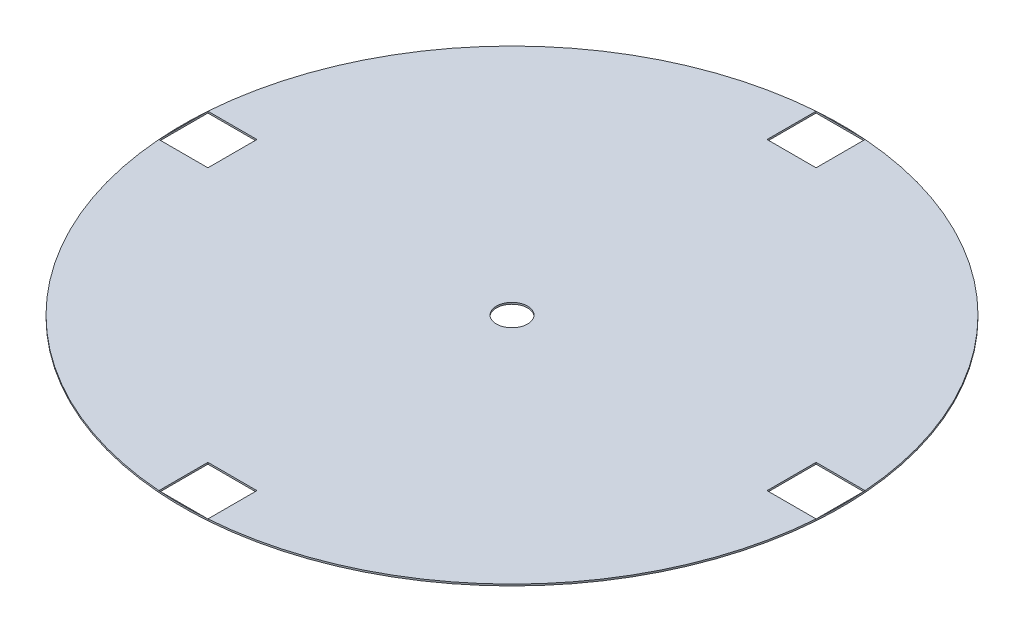
ISO-10303-21;
HEADER;
FILE_DESCRIPTION(('STEP AP214'),'2;1');
FILE_NAME('part.step','',(''),(''),'','','');
FILE_SCHEMA(('AUTOMOTIVE_DESIGN { 1 0 10303 214 1 1 1 1 }'));
ENDSEC;
DATA;
#1=APPLICATION_CONTEXT('core data for automotive mechanical design processes');
#2=APPLICATION_PROTOCOL_DEFINITION('international standard','automotive_design',2000,#1);
#3=PRODUCT_CONTEXT('',#1,'mechanical');
#4=PRODUCT('Part','Part','',(#3));
#5=PRODUCT_RELATED_PRODUCT_CATEGORY('part','',(#4));
#6=PRODUCT_DEFINITION_FORMATION('','',#4);
#7=PRODUCT_DEFINITION_CONTEXT('part definition',#1,'design');
#8=PRODUCT_DEFINITION('design','',#6,#7);
#9=PRODUCT_DEFINITION_SHAPE('','',#8);
#10=(LENGTH_UNIT() NAMED_UNIT(*) SI_UNIT(.MILLI.,.METRE.));
#11=(NAMED_UNIT(*) PLANE_ANGLE_UNIT() SI_UNIT($,.RADIAN.));
#12=(NAMED_UNIT(*) SI_UNIT($,.STERADIAN.) SOLID_ANGLE_UNIT());
#13=UNCERTAINTY_MEASURE_WITH_UNIT(LENGTH_MEASURE(1.E-05),#10,'distance_accuracy_value','');
#14=(GEOMETRIC_REPRESENTATION_CONTEXT(3) GLOBAL_UNCERTAINTY_ASSIGNED_CONTEXT((#13)) GLOBAL_UNIT_ASSIGNED_CONTEXT((#10,
#11,#12)) REPRESENTATION_CONTEXT('',''));
#15=CARTESIAN_POINT('',(0.,0.,0.));
#16=DIRECTION('',(0.,0.,1.));
#17=DIRECTION('',(1.,0.,0.));
#18=AXIS2_PLACEMENT_3D('',#15,#16,#17);
#19=CARTESIAN_POINT('',(0.,2.,0.));
#20=DIRECTION('',(0.,-1.,0.));
#21=DIRECTION('',(0.,0.,-1.));
#22=AXIS2_PLACEMENT_3D('',#19,#20,#21);
#23=CYLINDRICAL_SURFACE('',#22,403.28);
#24=CARTESIAN_POINT('',(0.,0.,0.));
#25=DIRECTION('',(0.,1.,0.));
#26=DIRECTION('',(0.,0.,1.));
#27=AXIS2_PLACEMENT_3D('',#24,#25,#26);
#28=CIRCLE('',#27,403.28);
#29=CARTESIAN_POINT('',(29.9999999999986,0.,402.162601941056));
#30=VERTEX_POINT('',#29);
#31=CARTESIAN_POINT('',(402.162601941056,0.,30.));
#32=VERTEX_POINT('',#31);
#33=EDGE_CURVE('E58',#30,#32,#28,.T.);
#34=ORIENTED_EDGE('',*,*,#33,.T.);
#35=DIRECTION('',(0.,-1.,0.));
#36=VECTOR('',#35,1.);
#37=CARTESIAN_POINT('',(402.162601941056,2.,30.));
#38=LINE('',#37,#36);
#39=CARTESIAN_POINT('',(402.162601941056,2.,30.));
#40=VERTEX_POINT('',#39);
#41=EDGE_CURVE('E164',#32,#40,#38,.F.);
#42=ORIENTED_EDGE('',*,*,#41,.T.);
#43=CARTESIAN_POINT('',(0.,2.,0.));
#44=DIRECTION('',(0.,1.,0.));
#45=DIRECTION('',(0.,0.,1.));
#46=AXIS2_PLACEMENT_3D('',#43,#44,#45);
#47=CIRCLE('',#46,403.28);
#48=CARTESIAN_POINT('',(29.9999999999986,2.,402.162601941056));
#49=VERTEX_POINT('',#48);
#50=EDGE_CURVE('E191',#49,#40,#47,.T.);
#51=ORIENTED_EDGE('',*,*,#50,.F.);
#52=DIRECTION('',(0.,-1.,0.));
#53=VECTOR('',#52,1.);
#54=CARTESIAN_POINT('',(29.9999999999986,2.,402.162601941056));
#55=LINE('',#54,#53);
#56=EDGE_CURVE('E175',#49,#30,#55,.T.);
#57=ORIENTED_EDGE('',*,*,#56,.T.);
#58=EDGE_LOOP('',(#34,#42,#51,#57));
#59=FACE_BOUND('',#58,.T.);
#60=ADVANCED_FACE('F54',(#59),#23,.T.);
#61=CARTESIAN_POINT('',(-402.162601941056,0.,29.9999999999972));
#62=VERTEX_POINT('',#61);
#63=CARTESIAN_POINT('',(-30.0000000000014,0.,402.162601941056));
#64=VERTEX_POINT('',#63);
#65=EDGE_CURVE('E181',#62,#64,#28,.T.);
#66=ORIENTED_EDGE('',*,*,#65,.T.);
#67=DIRECTION('',(0.,-1.,0.));
#68=VECTOR('',#67,1.);
#69=CARTESIAN_POINT('',(-30.0000000000014,2.,402.162601941056));
#70=LINE('',#69,#68);
#71=CARTESIAN_POINT('',(-30.0000000000014,2.,402.162601941056));
#72=VERTEX_POINT('',#71);
#73=EDGE_CURVE('E372',#64,#72,#70,.F.);
#74=ORIENTED_EDGE('',*,*,#73,.T.);
#75=CARTESIAN_POINT('',(-402.162601941056,2.,29.9999999999972));
#76=VERTEX_POINT('',#75);
#77=EDGE_CURVE('E200',#76,#72,#47,.T.);
#78=ORIENTED_EDGE('',*,*,#77,.F.);
#79=DIRECTION('',(0.,-1.,0.));
#80=VECTOR('',#79,1.);
#81=CARTESIAN_POINT('',(-402.162601941056,2.,29.9999999999972));
#82=LINE('',#81,#80);
#83=EDGE_CURVE('E370',#76,#62,#82,.T.);
#84=ORIENTED_EDGE('',*,*,#83,.T.);
#85=EDGE_LOOP('',(#66,#74,#78,#84));
#86=FACE_BOUND('',#85,.T.);
#87=ADVANCED_FACE('F315',(#86),#23,.T.);
#88=CARTESIAN_POINT('',(-29.9999999999958,0.,-402.162601941056));
#89=VERTEX_POINT('',#88);
#90=CARTESIAN_POINT('',(-402.162601941055,0.,-30.0000000000028));
#91=VERTEX_POINT('',#90);
#92=EDGE_CURVE('E220',#89,#91,#28,.T.);
#93=ORIENTED_EDGE('',*,*,#92,.T.);
#94=DIRECTION('',(0.,-1.,0.));
#95=VECTOR('',#94,1.);
#96=CARTESIAN_POINT('',(-402.162601941055,2.,-30.0000000000028));
#97=LINE('',#96,#95);
#98=CARTESIAN_POINT('',(-402.162601941055,2.,-30.0000000000028));
#99=VERTEX_POINT('',#98);
#100=EDGE_CURVE('E213',#91,#99,#97,.F.);
#101=ORIENTED_EDGE('',*,*,#100,.T.);
#102=CARTESIAN_POINT('',(-29.9999999999958,2.,-402.162601941056));
#103=VERTEX_POINT('',#102);
#104=EDGE_CURVE('E205',#103,#99,#47,.T.);
#105=ORIENTED_EDGE('',*,*,#104,.F.);
#106=DIRECTION('',(0.,-1.,0.));
#107=VECTOR('',#106,1.);
#108=CARTESIAN_POINT('',(-29.9999999999958,2.,-402.162601941056));
#109=LINE('',#108,#107);
#110=EDGE_CURVE('E207',#103,#89,#109,.T.);
#111=ORIENTED_EDGE('',*,*,#110,.T.);
#112=EDGE_LOOP('',(#93,#101,#105,#111));
#113=FACE_BOUND('',#112,.T.);
#114=ADVANCED_FACE('F298',(#113),#23,.T.);
#115=CARTESIAN_POINT('',(0.,2.,0.));
#116=DIRECTION('',(0.,1.,0.));
#117=DIRECTION('',(0.,0.,1.));
#118=AXIS2_PLACEMENT_3D('',#115,#116,#117);
#119=PLANE('',#118);
#120=DIRECTION('',(1.,0.,0.));
#121=VECTOR('',#120,1.);
#122=CARTESIAN_POINT('',(342.162601941056,2.,30.));
#123=LINE('',#122,#121);
#124=CARTESIAN_POINT('',(342.162601941056,2.,30.));
#125=VERTEX_POINT('',#124);
#126=EDGE_CURVE('E171',#125,#40,#123,.T.);
#127=ORIENTED_EDGE('',*,*,#126,.F.);
#128=DIRECTION('',(0.,0.,1.));
#129=VECTOR('',#128,1.);
#130=CARTESIAN_POINT('',(342.162601941056,2.,-30.));
#131=LINE('',#130,#129);
#132=CARTESIAN_POINT('',(342.162601941056,2.,-30.));
#133=VERTEX_POINT('',#132);
#134=EDGE_CURVE('E64',#133,#125,#131,.T.);
#135=ORIENTED_EDGE('',*,*,#134,.F.);
#136=DIRECTION('',(-1.,0.,0.));
#137=VECTOR('',#136,1.);
#138=CARTESIAN_POINT('',(402.162601941056,2.,-30.));
#139=LINE('',#138,#137);
#140=CARTESIAN_POINT('',(402.162601941056,2.,-30.));
#141=VERTEX_POINT('',#140);
#142=EDGE_CURVE('E194',#141,#133,#139,.T.);
#143=ORIENTED_EDGE('',*,*,#142,.F.);
#144=CARTESIAN_POINT('',(30.0000000000042,2.,-402.162601941055));
#145=VERTEX_POINT('',#144);
#146=EDGE_CURVE('E201',#141,#145,#47,.T.);
#147=ORIENTED_EDGE('',*,*,#146,.T.);
#148=DIRECTION('',(0.,0.,-1.));
#149=VECTOR('',#148,1.);
#150=CARTESIAN_POINT('',(29.9999999999999,2.,-342.162601941056));
#151=LINE('',#150,#149);
#152=CARTESIAN_POINT('',(29.9999999999999,2.,-342.162601941056));
#153=VERTEX_POINT('',#152);
#154=EDGE_CURVE('E232',#153,#145,#151,.T.);
#155=ORIENTED_EDGE('',*,*,#154,.F.);
#156=DIRECTION('',(1.,0.,0.));
#157=VECTOR('',#156,1.);
#158=CARTESIAN_POINT('',(-30.0000000000001,2.,-342.162601941056));
#159=LINE('',#158,#157);
#160=CARTESIAN_POINT('',(-30.0000000000001,2.,-342.162601941056));
#161=VERTEX_POINT('',#160);
#162=EDGE_CURVE('E245',#161,#153,#159,.T.);
#163=ORIENTED_EDGE('',*,*,#162,.F.);
#164=DIRECTION('',(0.,0.,1.));
#165=VECTOR('',#164,1.);
#166=CARTESIAN_POINT('',(-29.9999999999958,2.,-402.162601941056));
#167=LINE('',#166,#165);
#168=EDGE_CURVE('E242',#103,#161,#167,.T.);
#169=ORIENTED_EDGE('',*,*,#168,.F.);
#170=ORIENTED_EDGE('',*,*,#104,.T.);
#171=DIRECTION('',(-1.,0.,0.));
#172=VECTOR('',#171,1.);
#173=CARTESIAN_POINT('',(-342.162601941056,2.,-30.));
#174=LINE('',#173,#172);
#175=CARTESIAN_POINT('',(-342.162601941056,2.,-30.));
#176=VERTEX_POINT('',#175);
#177=EDGE_CURVE('E253',#176,#99,#174,.T.);
#178=ORIENTED_EDGE('',*,*,#177,.F.);
#179=DIRECTION('',(0.,0.,-1.));
#180=VECTOR('',#179,1.);
#181=CARTESIAN_POINT('',(-342.162601941056,2.,30.));
#182=LINE('',#181,#180);
#183=CARTESIAN_POINT('',(-342.162601941056,2.,30.));
#184=VERTEX_POINT('',#183);
#185=EDGE_CURVE('E266',#184,#176,#182,.T.);
#186=ORIENTED_EDGE('',*,*,#185,.F.);
#187=DIRECTION('',(1.,0.,0.));
#188=VECTOR('',#187,1.);
#189=CARTESIAN_POINT('',(-402.162601941056,2.,29.9999999999972));
#190=LINE('',#189,#188);
#191=EDGE_CURVE('E263',#76,#184,#190,.T.);
#192=ORIENTED_EDGE('',*,*,#191,.F.);
#193=ORIENTED_EDGE('',*,*,#77,.T.);
#194=DIRECTION('',(0.,0.,1.));
#195=VECTOR('',#194,1.);
#196=CARTESIAN_POINT('',(-30.0000000000001,2.,342.162601941056));
#197=LINE('',#196,#195);
#198=CARTESIAN_POINT('',(-30.0000000000001,2.,342.162601941056));
#199=VERTEX_POINT('',#198);
#200=EDGE_CURVE('E273',#199,#72,#197,.T.);
#201=ORIENTED_EDGE('',*,*,#200,.F.);
#202=DIRECTION('',(-1.,0.,0.));
#203=VECTOR('',#202,1.);
#204=CARTESIAN_POINT('',(30.0000000000001,2.,342.162601941056));
#205=LINE('',#204,#203);
#206=CARTESIAN_POINT('',(30.0000000000001,2.,342.162601941056));
#207=VERTEX_POINT('',#206);
#208=EDGE_CURVE('E282',#207,#199,#205,.T.);
#209=ORIENTED_EDGE('',*,*,#208,.F.);
#210=DIRECTION('',(0.,0.,-1.));
#211=VECTOR('',#210,1.);
#212=CARTESIAN_POINT('',(29.9999999999986,2.,402.162601941056));
#213=LINE('',#212,#211);
#214=EDGE_CURVE('E279',#49,#207,#213,.T.);
#215=ORIENTED_EDGE('',*,*,#214,.F.);
#216=ORIENTED_EDGE('',*,*,#50,.T.);
#217=EDGE_LOOP('',(#127,#135,#143,#147,#155,#163,#169,#170,#178,#186,#192,#193,#201,#209,#215,#216));
#218=FACE_BOUND('',#217,.T.);
#219=CARTESIAN_POINT('',(0.,2.,0.));
#220=DIRECTION('',(0.,1.,0.));
#221=DIRECTION('',(0.,0.,1.));
#222=AXIS2_PLACEMENT_3D('',#219,#220,#221);
#223=CIRCLE('',#222,19.05);
#224=CARTESIAN_POINT('',(0.,2.,19.05));
#225=VERTEX_POINT('',#224);
#226=EDGE_CURVE('E229',#225,#225,#223,.T.);
#227=ORIENTED_EDGE('',*,*,#226,.F.);
#228=EDGE_LOOP('',(#227));
#229=FACE_BOUND('',#228,.T.);
#230=ADVANCED_FACE('F56',(#218,#229),#119,.T.);
#231=CARTESIAN_POINT('',(0.,0.,0.));
#232=DIRECTION('',(0.,1.,0.));
#233=DIRECTION('',(0.,0.,1.));
#234=AXIS2_PLACEMENT_3D('',#231,#232,#233);
#235=PLANE('',#234);
#236=DIRECTION('',(0.,0.,1.));
#237=VECTOR('',#236,1.);
#238=CARTESIAN_POINT('',(342.162601941056,0.,-30.));
#239=LINE('',#238,#237);
#240=CARTESIAN_POINT('',(342.162601941056,0.,-30.));
#241=VERTEX_POINT('',#240);
#242=CARTESIAN_POINT('',(342.162601941056,0.,30.));
#243=VERTEX_POINT('',#242);
#244=EDGE_CURVE('E186',#241,#243,#239,.T.);
#245=ORIENTED_EDGE('',*,*,#244,.T.);
#246=DIRECTION('',(1.,0.,0.));
#247=VECTOR('',#246,1.);
#248=CARTESIAN_POINT('',(342.162601941056,0.,30.));
#249=LINE('',#248,#247);
#250=EDGE_CURVE('E168',#243,#32,#249,.T.);
#251=ORIENTED_EDGE('',*,*,#250,.T.);
#252=ORIENTED_EDGE('',*,*,#33,.F.);
#253=DIRECTION('',(0.,0.,-1.));
#254=VECTOR('',#253,1.);
#255=CARTESIAN_POINT('',(29.9999999999986,0.,402.162601941056));
#256=LINE('',#255,#254);
#257=CARTESIAN_POINT('',(30.0000000000001,0.,342.162601941056));
#258=VERTEX_POINT('',#257);
#259=EDGE_CURVE('E187',#30,#258,#256,.T.);
#260=ORIENTED_EDGE('',*,*,#259,.T.);
#261=DIRECTION('',(-1.,0.,0.));
#262=VECTOR('',#261,1.);
#263=CARTESIAN_POINT('',(30.0000000000001,0.,342.162601941056));
#264=LINE('',#263,#262);
#265=CARTESIAN_POINT('',(-30.0000000000001,0.,342.162601941056));
#266=VERTEX_POINT('',#265);
#267=EDGE_CURVE('E189',#258,#266,#264,.T.);
#268=ORIENTED_EDGE('',*,*,#267,.T.);
#269=DIRECTION('',(0.,0.,1.));
#270=VECTOR('',#269,1.);
#271=CARTESIAN_POINT('',(-30.0000000000001,0.,342.162601941056));
#272=LINE('',#271,#270);
#273=EDGE_CURVE('E258',#266,#64,#272,.T.);
#274=ORIENTED_EDGE('',*,*,#273,.T.);
#275=ORIENTED_EDGE('',*,*,#65,.F.);
#276=DIRECTION('',(1.,0.,0.));
#277=VECTOR('',#276,1.);
#278=CARTESIAN_POINT('',(-402.162601941056,0.,29.9999999999972));
#279=LINE('',#278,#277);
#280=CARTESIAN_POINT('',(-342.162601941056,0.,30.));
#281=VERTEX_POINT('',#280);
#282=EDGE_CURVE('E254',#62,#281,#279,.T.);
#283=ORIENTED_EDGE('',*,*,#282,.T.);
#284=DIRECTION('',(0.,0.,-1.));
#285=VECTOR('',#284,1.);
#286=CARTESIAN_POINT('',(-342.162601941056,0.,30.));
#287=LINE('',#286,#285);
#288=CARTESIAN_POINT('',(-342.162601941056,0.,-30.));
#289=VERTEX_POINT('',#288);
#290=EDGE_CURVE('E257',#281,#289,#287,.T.);
#291=ORIENTED_EDGE('',*,*,#290,.T.);
#292=DIRECTION('',(-1.,0.,0.));
#293=VECTOR('',#292,1.);
#294=CARTESIAN_POINT('',(-342.162601941056,0.,-30.));
#295=LINE('',#294,#293);
#296=EDGE_CURVE('E237',#289,#91,#295,.T.);
#297=ORIENTED_EDGE('',*,*,#296,.T.);
#298=ORIENTED_EDGE('',*,*,#92,.F.);
#299=DIRECTION('',(0.,0.,1.));
#300=VECTOR('',#299,1.);
#301=CARTESIAN_POINT('',(-29.9999999999958,0.,-402.162601941056));
#302=LINE('',#301,#300);
#303=CARTESIAN_POINT('',(-30.0000000000001,0.,-342.162601941056));
#304=VERTEX_POINT('',#303);
#305=EDGE_CURVE('E233',#89,#304,#302,.T.);
#306=ORIENTED_EDGE('',*,*,#305,.T.);
#307=DIRECTION('',(1.,0.,0.));
#308=VECTOR('',#307,1.);
#309=CARTESIAN_POINT('',(-30.0000000000001,0.,-342.162601941056));
#310=LINE('',#309,#308);
#311=CARTESIAN_POINT('',(29.9999999999999,0.,-342.162601941056));
#312=VERTEX_POINT('',#311);
#313=EDGE_CURVE('E236',#304,#312,#310,.T.);
#314=ORIENTED_EDGE('',*,*,#313,.T.);
#315=DIRECTION('',(0.,0.,-1.));
#316=VECTOR('',#315,1.);
#317=CARTESIAN_POINT('',(29.9999999999999,0.,-342.162601941056));
#318=LINE('',#317,#316);
#319=CARTESIAN_POINT('',(30.0000000000042,0.,-402.162601941055));
#320=VERTEX_POINT('',#319);
#321=EDGE_CURVE('E199',#312,#320,#318,.T.);
#322=ORIENTED_EDGE('',*,*,#321,.T.);
#323=CARTESIAN_POINT('',(402.162601941056,0.,-30.));
#324=VERTEX_POINT('',#323);
#325=EDGE_CURVE('E182',#324,#320,#28,.T.);
#326=ORIENTED_EDGE('',*,*,#325,.F.);
#327=DIRECTION('',(-1.,0.,0.));
#328=VECTOR('',#327,1.);
#329=CARTESIAN_POINT('',(402.162601941056,0.,-30.));
#330=LINE('',#329,#328);
#331=EDGE_CURVE('E197',#324,#241,#330,.T.);
#332=ORIENTED_EDGE('',*,*,#331,.T.);
#333=EDGE_LOOP('',(#245,#251,#252,#260,#268,#274,#275,#283,#291,#297,#298,#306,#314,#322,#326,#332));
#334=FACE_BOUND('',#333,.T.);
#335=CARTESIAN_POINT('',(0.,0.,0.));
#336=DIRECTION('',(0.,1.,0.));
#337=DIRECTION('',(0.,0.,1.));
#338=AXIS2_PLACEMENT_3D('',#335,#336,#337);
#339=CIRCLE('',#338,19.05);
#340=CARTESIAN_POINT('',(0.,0.,19.05));
#341=VERTEX_POINT('',#340);
#342=EDGE_CURVE('E198',#341,#341,#339,.T.);
#343=ORIENTED_EDGE('',*,*,#342,.T.);
#344=EDGE_LOOP('',(#343));
#345=FACE_BOUND('',#344,.T.);
#346=ADVANCED_FACE('F183',(#334,#345),#235,.F.);
#347=ORIENTED_EDGE('',*,*,#146,.F.);
#348=DIRECTION('',(0.,-1.,0.));
#349=VECTOR('',#348,1.);
#350=CARTESIAN_POINT('',(402.162601941056,2.,-30.));
#351=LINE('',#350,#349);
#352=EDGE_CURVE('E228',#141,#324,#351,.T.);
#353=ORIENTED_EDGE('',*,*,#352,.T.);
#354=ORIENTED_EDGE('',*,*,#325,.T.);
#355=DIRECTION('',(0.,-1.,0.));
#356=VECTOR('',#355,1.);
#357=CARTESIAN_POINT('',(30.0000000000042,2.,-402.162601941055));
#358=LINE('',#357,#356);
#359=EDGE_CURVE('E224',#320,#145,#358,.F.);
#360=ORIENTED_EDGE('',*,*,#359,.T.);
#361=EDGE_LOOP('',(#347,#353,#354,#360));
#362=FACE_BOUND('',#361,.T.);
#363=ADVANCED_FACE('F305',(#362),#23,.T.);
#364=CARTESIAN_POINT('',(0.,2.,0.));
#365=DIRECTION('',(0.,-1.,0.));
#366=DIRECTION('',(0.,0.,-1.));
#367=AXIS2_PLACEMENT_3D('',#364,#365,#366);
#368=CYLINDRICAL_SURFACE('',#367,19.05);
#369=ORIENTED_EDGE('',*,*,#226,.T.);
#370=EDGE_LOOP('',(#369));
#371=FACE_BOUND('',#370,.T.);
#372=ORIENTED_EDGE('',*,*,#342,.F.);
#373=EDGE_LOOP('',(#372));
#374=FACE_BOUND('',#373,.T.);
#375=ADVANCED_FACE('F301',(#371,#374),#368,.F.);
#376=CARTESIAN_POINT('',(29.9999999999999,0.,-342.162601941056));
#377=DIRECTION('',(1.,0.,0.));
#378=DIRECTION('',(0.,0.,-1.));
#379=AXIS2_PLACEMENT_3D('',#376,#377,#378);
#380=PLANE('',#379);
#381=ORIENTED_EDGE('',*,*,#154,.T.);
#382=ORIENTED_EDGE('',*,*,#359,.F.);
#383=ORIENTED_EDGE('',*,*,#321,.F.);
#384=DIRECTION('',(0.,1.,0.));
#385=VECTOR('',#384,1.);
#386=CARTESIAN_POINT('',(29.9999999999999,0.,-342.162601941056));
#387=LINE('',#386,#385);
#388=EDGE_CURVE('E246',#312,#153,#387,.T.);
#389=ORIENTED_EDGE('',*,*,#388,.T.);
#390=EDGE_LOOP('',(#381,#382,#383,#389));
#391=FACE_BOUND('',#390,.T.);
#392=ADVANCED_FACE('F304',(#391),#380,.F.);
#393=CARTESIAN_POINT('',(-29.9999999999958,0.,-402.162601941056));
#394=DIRECTION('',(-1.,0.,0.));
#395=DIRECTION('',(0.,0.,1.));
#396=AXIS2_PLACEMENT_3D('',#393,#394,#395);
#397=PLANE('',#396);
#398=ORIENTED_EDGE('',*,*,#168,.T.);
#399=DIRECTION('',(0.,1.,0.));
#400=VECTOR('',#399,1.);
#401=CARTESIAN_POINT('',(-30.0000000000001,0.,-342.162601941056));
#402=LINE('',#401,#400);
#403=EDGE_CURVE('E249',#304,#161,#402,.T.);
#404=ORIENTED_EDGE('',*,*,#403,.F.);
#405=ORIENTED_EDGE('',*,*,#305,.F.);
#406=ORIENTED_EDGE('',*,*,#110,.F.);
#407=EDGE_LOOP('',(#398,#404,#405,#406));
#408=FACE_BOUND('',#407,.T.);
#409=ADVANCED_FACE('F353',(#408),#397,.F.);
#410=CARTESIAN_POINT('',(-30.0000000000001,0.,-342.162601941056));
#411=DIRECTION('',(0.,0.,1.));
#412=DIRECTION('',(1.,0.,0.));
#413=AXIS2_PLACEMENT_3D('',#410,#411,#412);
#414=PLANE('',#413);
#415=ORIENTED_EDGE('',*,*,#162,.T.);
#416=ORIENTED_EDGE('',*,*,#388,.F.);
#417=ORIENTED_EDGE('',*,*,#313,.F.);
#418=ORIENTED_EDGE('',*,*,#403,.T.);
#419=EDGE_LOOP('',(#415,#416,#417,#418));
#420=FACE_BOUND('',#419,.T.);
#421=ADVANCED_FACE('F351',(#420),#414,.F.);
#422=CARTESIAN_POINT('',(-342.162601941056,0.,-30.));
#423=DIRECTION('',(0.,0.,-1.));
#424=DIRECTION('',(-1.,0.,0.));
#425=AXIS2_PLACEMENT_3D('',#422,#423,#424);
#426=PLANE('',#425);
#427=ORIENTED_EDGE('',*,*,#177,.T.);
#428=ORIENTED_EDGE('',*,*,#100,.F.);
#429=ORIENTED_EDGE('',*,*,#296,.F.);
#430=DIRECTION('',(0.,1.,0.));
#431=VECTOR('',#430,1.);
#432=CARTESIAN_POINT('',(-342.162601941056,0.,-30.));
#433=LINE('',#432,#431);
#434=EDGE_CURVE('E267',#289,#176,#433,.T.);
#435=ORIENTED_EDGE('',*,*,#434,.T.);
#436=EDGE_LOOP('',(#427,#428,#429,#435));
#437=FACE_BOUND('',#436,.T.);
#438=ADVANCED_FACE('F344',(#437),#426,.F.);
#439=CARTESIAN_POINT('',(-402.162601941056,0.,29.9999999999972));
#440=DIRECTION('',(0.,0.,1.));
#441=DIRECTION('',(1.,0.,0.));
#442=AXIS2_PLACEMENT_3D('',#439,#440,#441);
#443=PLANE('',#442);
#444=ORIENTED_EDGE('',*,*,#191,.T.);
#445=DIRECTION('',(0.,1.,0.));
#446=VECTOR('',#445,1.);
#447=CARTESIAN_POINT('',(-342.162601941056,0.,30.));
#448=LINE('',#447,#446);
#449=EDGE_CURVE('E270',#281,#184,#448,.T.);
#450=ORIENTED_EDGE('',*,*,#449,.F.);
#451=ORIENTED_EDGE('',*,*,#282,.F.);
#452=ORIENTED_EDGE('',*,*,#83,.F.);
#453=EDGE_LOOP('',(#444,#450,#451,#452));
#454=FACE_BOUND('',#453,.T.);
#455=ADVANCED_FACE('F341',(#454),#443,.F.);
#456=CARTESIAN_POINT('',(-342.162601941056,0.,30.));
#457=DIRECTION('',(1.,0.,0.));
#458=DIRECTION('',(0.,0.,-1.));
#459=AXIS2_PLACEMENT_3D('',#456,#457,#458);
#460=PLANE('',#459);
#461=ORIENTED_EDGE('',*,*,#185,.T.);
#462=ORIENTED_EDGE('',*,*,#434,.F.);
#463=ORIENTED_EDGE('',*,*,#290,.F.);
#464=ORIENTED_EDGE('',*,*,#449,.T.);
#465=EDGE_LOOP('',(#461,#462,#463,#464));
#466=FACE_BOUND('',#465,.T.);
#467=ADVANCED_FACE('F339',(#466),#460,.F.);
#468=CARTESIAN_POINT('',(-30.0000000000001,0.,342.162601941056));
#469=DIRECTION('',(-1.,0.,0.));
#470=DIRECTION('',(0.,0.,1.));
#471=AXIS2_PLACEMENT_3D('',#468,#469,#470);
#472=PLANE('',#471);
#473=ORIENTED_EDGE('',*,*,#200,.T.);
#474=ORIENTED_EDGE('',*,*,#73,.F.);
#475=ORIENTED_EDGE('',*,*,#273,.F.);
#476=DIRECTION('',(0.,1.,0.));
#477=VECTOR('',#476,1.);
#478=CARTESIAN_POINT('',(-30.0000000000001,0.,342.162601941056));
#479=LINE('',#478,#477);
#480=EDGE_CURVE('E283',#266,#199,#479,.T.);
#481=ORIENTED_EDGE('',*,*,#480,.T.);
#482=EDGE_LOOP('',(#473,#474,#475,#481));
#483=FACE_BOUND('',#482,.T.);
#484=ADVANCED_FACE('F332',(#483),#472,.F.);
#485=CARTESIAN_POINT('',(29.9999999999986,0.,402.162601941056));
#486=DIRECTION('',(1.,0.,0.));
#487=DIRECTION('',(0.,0.,-1.));
#488=AXIS2_PLACEMENT_3D('',#485,#486,#487);
#489=PLANE('',#488);
#490=ORIENTED_EDGE('',*,*,#214,.T.);
#491=DIRECTION('',(0.,1.,0.));
#492=VECTOR('',#491,1.);
#493=CARTESIAN_POINT('',(30.0000000000001,0.,342.162601941056));
#494=LINE('',#493,#492);
#495=EDGE_CURVE('E286',#258,#207,#494,.T.);
#496=ORIENTED_EDGE('',*,*,#495,.F.);
#497=ORIENTED_EDGE('',*,*,#259,.F.);
#498=ORIENTED_EDGE('',*,*,#56,.F.);
#499=EDGE_LOOP('',(#490,#496,#497,#498));
#500=FACE_BOUND('',#499,.T.);
#501=ADVANCED_FACE('F329',(#500),#489,.F.);
#502=CARTESIAN_POINT('',(30.0000000000001,0.,342.162601941056));
#503=DIRECTION('',(0.,0.,-1.));
#504=DIRECTION('',(-1.,0.,0.));
#505=AXIS2_PLACEMENT_3D('',#502,#503,#504);
#506=PLANE('',#505);
#507=ORIENTED_EDGE('',*,*,#208,.T.);
#508=ORIENTED_EDGE('',*,*,#480,.F.);
#509=ORIENTED_EDGE('',*,*,#267,.F.);
#510=ORIENTED_EDGE('',*,*,#495,.T.);
#511=EDGE_LOOP('',(#507,#508,#509,#510));
#512=FACE_BOUND('',#511,.T.);
#513=ADVANCED_FACE('F323',(#512),#506,.F.);
#514=CARTESIAN_POINT('',(342.162601941056,0.,30.));
#515=DIRECTION('',(0.,0.,1.));
#516=DIRECTION('',(1.,0.,0.));
#517=AXIS2_PLACEMENT_3D('',#514,#515,#516);
#518=PLANE('',#517);
#519=ORIENTED_EDGE('',*,*,#126,.T.);
#520=ORIENTED_EDGE('',*,*,#41,.F.);
#521=ORIENTED_EDGE('',*,*,#250,.F.);
#522=DIRECTION('',(0.,1.,0.));
#523=VECTOR('',#522,1.);
#524=CARTESIAN_POINT('',(342.162601941056,0.,30.));
#525=LINE('',#524,#523);
#526=EDGE_CURVE('E290',#243,#125,#525,.T.);
#527=ORIENTED_EDGE('',*,*,#526,.T.);
#528=EDGE_LOOP('',(#519,#520,#521,#527));
#529=FACE_BOUND('',#528,.T.);
#530=ADVANCED_FACE('F166',(#529),#518,.F.);
#531=CARTESIAN_POINT('',(402.162601941056,0.,-30.));
#532=DIRECTION('',(0.,0.,-1.));
#533=DIRECTION('',(-1.,0.,0.));
#534=AXIS2_PLACEMENT_3D('',#531,#532,#533);
#535=PLANE('',#534);
#536=ORIENTED_EDGE('',*,*,#142,.T.);
#537=DIRECTION('',(0.,1.,0.));
#538=VECTOR('',#537,1.);
#539=CARTESIAN_POINT('',(342.162601941056,0.,-30.));
#540=LINE('',#539,#538);
#541=EDGE_CURVE('E12',#241,#133,#540,.T.);
#542=ORIENTED_EDGE('',*,*,#541,.F.);
#543=ORIENTED_EDGE('',*,*,#331,.F.);
#544=ORIENTED_EDGE('',*,*,#352,.F.);
#545=EDGE_LOOP('',(#536,#542,#543,#544));
#546=FACE_BOUND('',#545,.T.);
#547=ADVANCED_FACE('F294',(#546),#535,.F.);
#548=CARTESIAN_POINT('',(342.162601941056,0.,-30.));
#549=DIRECTION('',(-1.,0.,0.));
#550=DIRECTION('',(0.,0.,1.));
#551=AXIS2_PLACEMENT_3D('',#548,#549,#550);
#552=PLANE('',#551);
#553=ORIENTED_EDGE('',*,*,#134,.T.);
#554=ORIENTED_EDGE('',*,*,#526,.F.);
#555=ORIENTED_EDGE('',*,*,#244,.F.);
#556=ORIENTED_EDGE('',*,*,#541,.T.);
#557=EDGE_LOOP('',(#553,#554,#555,#556));
#558=FACE_BOUND('',#557,.T.);
#559=ADVANCED_FACE('F324',(#558),#552,.F.);
#560=CLOSED_SHELL('',(#60,#87,#114,#230,#346,#363,#375,#392,#409,#421,#438,#455,#467,#484,#501,
#513,#530,#547,#559));
#561=MANIFOLD_SOLID_BREP('B2',#560);
#562=CARTESIAN_POINT('',(0.,2.,0.));
#563=DIRECTION('',(0.,-1.,0.));
#564=DIRECTION('',(0.,0.,-1.));
#565=AXIS2_PLACEMENT_3D('',#562,#563,#564);
#566=CYLINDRICAL_SURFACE('',#565,403.28);
#567=DIRECTION('',(0.,1.,0.));
#568=VECTOR('',#567,1.);
#569=CARTESIAN_POINT('',(30.0000000000042,0.,-402.162601941055));
#570=LINE('',#569,#568);
#571=CARTESIAN_POINT('',(30.0000000000042,0.,-402.162601941055));
#572=VERTEX_POINT('',#571);
#573=CARTESIAN_POINT('',(30.0000000000042,2.,-402.162601941055));
#574=VERTEX_POINT('',#573);
#575=EDGE_CURVE('E52',#572,#574,#570,.T.);
#576=ORIENTED_EDGE('',*,*,#575,.F.);
#577=CARTESIAN_POINT('',(0.,0.,0.));
#578=DIRECTION('',(0.,1.,0.));
#579=DIRECTION('',(0.,0.,1.));
#580=AXIS2_PLACEMENT_3D('',#577,#578,#579);
#581=CIRCLE('',#580,403.28);
#582=CARTESIAN_POINT('',(-29.9999999999958,0.,-402.162601941056));
#583=VERTEX_POINT('',#582);
#584=EDGE_CURVE('E516',#572,#583,#581,.T.);
#585=ORIENTED_EDGE('',*,*,#584,.T.);
#586=DIRECTION('',(0.,1.,0.));
#587=VECTOR('',#586,1.);
#588=CARTESIAN_POINT('',(-29.9999999999958,0.,-402.162601941056));
#589=LINE('',#588,#587);
#590=CARTESIAN_POINT('',(-29.9999999999958,2.,-402.162601941056));
#591=VERTEX_POINT('',#590);
#592=EDGE_CURVE('E537',#583,#591,#589,.T.);
#593=ORIENTED_EDGE('',*,*,#592,.T.);
#594=CARTESIAN_POINT('',(0.,2.,0.));
#595=DIRECTION('',(0.,1.,0.));
#596=DIRECTION('',(0.,0.,1.));
#597=AXIS2_PLACEMENT_3D('',#594,#595,#596);
#598=CIRCLE('',#597,403.28);
#599=EDGE_CURVE('E541',#574,#591,#598,.T.);
#600=ORIENTED_EDGE('',*,*,#599,.F.);
#601=EDGE_LOOP('',(#576,#585,#593,#600));
#602=FACE_BOUND('',#601,.T.);
#603=ADVANCED_FACE('F512',(#602),#566,.T.);
#604=CARTESIAN_POINT('',(0.,0.,0.));
#605=DIRECTION('',(0.,1.,0.));
#606=DIRECTION('',(0.,0.,1.));
#607=AXIS2_PLACEMENT_3D('',#604,#605,#606);
#608=PLANE('',#607);
#609=ORIENTED_EDGE('',*,*,#584,.F.);
#610=DIRECTION('',(-1.,0.,0.));
#611=VECTOR('',#610,1.);
#612=CARTESIAN_POINT('',(30.0000000000042,0.,-402.162601941055));
#613=LINE('',#612,#611);
#614=EDGE_CURVE('E546',#572,#583,#613,.T.);
#615=ORIENTED_EDGE('',*,*,#614,.T.);
#616=EDGE_LOOP('',(#609,#615));
#617=FACE_BOUND('',#616,.T.);
#618=ADVANCED_FACE('F550',(#617),#608,.F.);
#619=CARTESIAN_POINT('',(0.,2.,0.));
#620=DIRECTION('',(0.,1.,0.));
#621=DIRECTION('',(0.,0.,1.));
#622=AXIS2_PLACEMENT_3D('',#619,#620,#621);
#623=PLANE('',#622);
#624=DIRECTION('',(-1.,0.,0.));
#625=VECTOR('',#624,1.);
#626=CARTESIAN_POINT('',(30.0000000000042,2.,-402.162601941055));
#627=LINE('',#626,#625);
#628=EDGE_CURVE('E522',#574,#591,#627,.T.);
#629=ORIENTED_EDGE('',*,*,#628,.F.);
#630=ORIENTED_EDGE('',*,*,#599,.T.);
#631=EDGE_LOOP('',(#629,#630));
#632=FACE_BOUND('',#631,.T.);
#633=ADVANCED_FACE('F514',(#632),#623,.T.);
#634=CARTESIAN_POINT('',(30.0000000000042,0.,-402.162601941055));
#635=DIRECTION('',(0.,0.,-1.));
#636=DIRECTION('',(-1.,0.,0.));
#637=AXIS2_PLACEMENT_3D('',#634,#635,#636);
#638=PLANE('',#637);
#639=ORIENTED_EDGE('',*,*,#628,.T.);
#640=ORIENTED_EDGE('',*,*,#592,.F.);
#641=ORIENTED_EDGE('',*,*,#614,.F.);
#642=ORIENTED_EDGE('',*,*,#575,.T.);
#643=EDGE_LOOP('',(#639,#640,#641,#642));
#644=FACE_BOUND('',#643,.T.);
#645=ADVANCED_FACE('F536',(#644),#638,.F.);
#646=CLOSED_SHELL('',(#603,#618,#633,#645));
#647=MANIFOLD_SOLID_BREP('B6',#646);
#648=CARTESIAN_POINT('',(0.,2.,0.));
#649=DIRECTION('',(0.,-1.,0.));
#650=DIRECTION('',(0.,0.,-1.));
#651=AXIS2_PLACEMENT_3D('',#648,#649,#650);
#652=CYLINDRICAL_SURFACE('',#651,403.28);
#653=DIRECTION('',(0.,1.,0.));
#654=VECTOR('',#653,1.);
#655=CARTESIAN_POINT('',(-402.162601941055,0.,-30.0000000000028));
#656=LINE('',#655,#654);
#657=CARTESIAN_POINT('',(-402.162601941055,0.,-30.0000000000028));
#658=VERTEX_POINT('',#657);
#659=CARTESIAN_POINT('',(-402.162601941055,2.,-30.0000000000028));
#660=VERTEX_POINT('',#659);
#661=EDGE_CURVE('E510',#658,#660,#656,.T.);
#662=ORIENTED_EDGE('',*,*,#661,.F.);
#663=CARTESIAN_POINT('',(0.,0.,0.));
#664=DIRECTION('',(0.,1.,0.));
#665=DIRECTION('',(0.,0.,1.));
#666=AXIS2_PLACEMENT_3D('',#663,#664,#665);
#667=CIRCLE('',#666,403.28);
#668=CARTESIAN_POINT('',(-402.162601941056,0.,29.9999999999972));
#669=VERTEX_POINT('',#668);
#670=EDGE_CURVE('E598',#658,#669,#667,.T.);
#671=ORIENTED_EDGE('',*,*,#670,.T.);
#672=DIRECTION('',(0.,1.,0.));
#673=VECTOR('',#672,1.);
#674=CARTESIAN_POINT('',(-402.162601941056,0.,29.9999999999972));
#675=LINE('',#674,#673);
#676=CARTESIAN_POINT('',(-402.162601941056,2.,29.9999999999972));
#677=VERTEX_POINT('',#676);
#678=EDGE_CURVE('E619',#669,#677,#675,.T.);
#679=ORIENTED_EDGE('',*,*,#678,.T.);
#680=CARTESIAN_POINT('',(0.,2.,0.));
#681=DIRECTION('',(0.,1.,0.));
#682=DIRECTION('',(0.,0.,1.));
#683=AXIS2_PLACEMENT_3D('',#680,#681,#682);
#684=CIRCLE('',#683,403.28);
#685=EDGE_CURVE('E623',#660,#677,#684,.T.);
#686=ORIENTED_EDGE('',*,*,#685,.F.);
#687=EDGE_LOOP('',(#662,#671,#679,#686));
#688=FACE_BOUND('',#687,.T.);
#689=ADVANCED_FACE('F594',(#688),#652,.T.);
#690=CARTESIAN_POINT('',(0.,0.,0.));
#691=DIRECTION('',(0.,1.,0.));
#692=DIRECTION('',(0.,0.,1.));
#693=AXIS2_PLACEMENT_3D('',#690,#691,#692);
#694=PLANE('',#693);
#695=ORIENTED_EDGE('',*,*,#670,.F.);
#696=DIRECTION('',(0.,0.,1.));
#697=VECTOR('',#696,1.);
#698=CARTESIAN_POINT('',(-402.162601941055,0.,-30.0000000000028));
#699=LINE('',#698,#697);
#700=EDGE_CURVE('E628',#658,#669,#699,.T.);
#701=ORIENTED_EDGE('',*,*,#700,.T.);
#702=EDGE_LOOP('',(#695,#701));
#703=FACE_BOUND('',#702,.T.);
#704=ADVANCED_FACE('F632',(#703),#694,.F.);
#705=CARTESIAN_POINT('',(0.,2.,0.));
#706=DIRECTION('',(0.,1.,0.));
#707=DIRECTION('',(0.,0.,1.));
#708=AXIS2_PLACEMENT_3D('',#705,#706,#707);
#709=PLANE('',#708);
#710=DIRECTION('',(0.,0.,1.));
#711=VECTOR('',#710,1.);
#712=CARTESIAN_POINT('',(-402.162601941055,2.,-30.0000000000028));
#713=LINE('',#712,#711);
#714=EDGE_CURVE('E604',#660,#677,#713,.T.);
#715=ORIENTED_EDGE('',*,*,#714,.F.);
#716=ORIENTED_EDGE('',*,*,#685,.T.);
#717=EDGE_LOOP('',(#715,#716));
#718=FACE_BOUND('',#717,.T.);
#719=ADVANCED_FACE('F596',(#718),#709,.T.);
#720=CARTESIAN_POINT('',(-402.162601941055,0.,-30.0000000000028));
#721=DIRECTION('',(-1.,0.,0.));
#722=DIRECTION('',(0.,0.,1.));
#723=AXIS2_PLACEMENT_3D('',#720,#721,#722);
#724=PLANE('',#723);
#725=ORIENTED_EDGE('',*,*,#714,.T.);
#726=ORIENTED_EDGE('',*,*,#678,.F.);
#727=ORIENTED_EDGE('',*,*,#700,.F.);
#728=ORIENTED_EDGE('',*,*,#661,.T.);
#729=EDGE_LOOP('',(#725,#726,#727,#728));
#730=FACE_BOUND('',#729,.T.);
#731=ADVANCED_FACE('F618',(#730),#724,.F.);
#732=CLOSED_SHELL('',(#689,#704,#719,#731));
#733=MANIFOLD_SOLID_BREP('B46',#732);
#734=CARTESIAN_POINT('',(0.,2.,0.));
#735=DIRECTION('',(0.,-1.,0.));
#736=DIRECTION('',(0.,0.,-1.));
#737=AXIS2_PLACEMENT_3D('',#734,#735,#736);
#738=CYLINDRICAL_SURFACE('',#737,403.28);
#739=DIRECTION('',(0.,1.,0.));
#740=VECTOR('',#739,1.);
#741=CARTESIAN_POINT('',(-30.0000000000014,0.,402.162601941056));
#742=LINE('',#741,#740);
#743=CARTESIAN_POINT('',(-30.0000000000014,0.,402.162601941056));
#744=VERTEX_POINT('',#743);
#745=CARTESIAN_POINT('',(-30.0000000000014,2.,402.162601941056));
#746=VERTEX_POINT('',#745);
#747=EDGE_CURVE('E592',#744,#746,#742,.T.);
#748=ORIENTED_EDGE('',*,*,#747,.F.);
#749=CARTESIAN_POINT('',(0.,0.,0.));
#750=DIRECTION('',(0.,1.,0.));
#751=DIRECTION('',(0.,0.,1.));
#752=AXIS2_PLACEMENT_3D('',#749,#750,#751);
#753=CIRCLE('',#752,403.28);
#754=CARTESIAN_POINT('',(29.9999999999986,0.,402.162601941056));
#755=VERTEX_POINT('',#754);
#756=EDGE_CURVE('E679',#744,#755,#753,.T.);
#757=ORIENTED_EDGE('',*,*,#756,.T.);
#758=DIRECTION('',(0.,1.,0.));
#759=VECTOR('',#758,1.);
#760=CARTESIAN_POINT('',(29.9999999999986,0.,402.162601941056));
#761=LINE('',#760,#759);
#762=CARTESIAN_POINT('',(29.9999999999987,2.,402.162601941056));
#763=VERTEX_POINT('',#762);
#764=EDGE_CURVE('E700',#755,#763,#761,.T.);
#765=ORIENTED_EDGE('',*,*,#764,.T.);
#766=CARTESIAN_POINT('',(0.,2.,0.));
#767=DIRECTION('',(0.,1.,0.));
#768=DIRECTION('',(0.,0.,1.));
#769=AXIS2_PLACEMENT_3D('',#766,#767,#768);
#770=CIRCLE('',#769,403.28);
#771=EDGE_CURVE('E704',#746,#763,#770,.T.);
#772=ORIENTED_EDGE('',*,*,#771,.F.);
#773=EDGE_LOOP('',(#748,#757,#765,#772));
#774=FACE_BOUND('',#773,.T.);
#775=ADVANCED_FACE('F675',(#774),#738,.T.);
#776=CARTESIAN_POINT('',(0.,0.,0.));
#777=DIRECTION('',(0.,1.,0.));
#778=DIRECTION('',(0.,0.,1.));
#779=AXIS2_PLACEMENT_3D('',#776,#777,#778);
#780=PLANE('',#779);
#781=ORIENTED_EDGE('',*,*,#756,.F.);
#782=DIRECTION('',(1.,0.,0.));
#783=VECTOR('',#782,1.);
#784=CARTESIAN_POINT('',(-30.0000000000014,0.,402.162601941056));
#785=LINE('',#784,#783);
#786=EDGE_CURVE('E709',#744,#755,#785,.T.);
#787=ORIENTED_EDGE('',*,*,#786,.T.);
#788=EDGE_LOOP('',(#781,#787));
#789=FACE_BOUND('',#788,.T.);
#790=ADVANCED_FACE('F713',(#789),#780,.F.);
#791=CARTESIAN_POINT('',(0.,2.,0.));
#792=DIRECTION('',(0.,1.,0.));
#793=DIRECTION('',(0.,0.,1.));
#794=AXIS2_PLACEMENT_3D('',#791,#792,#793);
#795=PLANE('',#794);
#796=DIRECTION('',(1.,0.,0.));
#797=VECTOR('',#796,1.);
#798=CARTESIAN_POINT('',(-30.0000000000014,2.,402.162601941056));
#799=LINE('',#798,#797);
#800=EDGE_CURVE('E685',#746,#763,#799,.T.);
#801=ORIENTED_EDGE('',*,*,#800,.F.);
#802=ORIENTED_EDGE('',*,*,#771,.T.);
#803=EDGE_LOOP('',(#801,#802));
#804=FACE_BOUND('',#803,.T.);
#805=ADVANCED_FACE('F677',(#804),#795,.T.);
#806=CARTESIAN_POINT('',(-30.0000000000014,0.,402.162601941056));
#807=DIRECTION('',(0.,0.,1.));
#808=DIRECTION('',(1.,0.,0.));
#809=AXIS2_PLACEMENT_3D('',#806,#807,#808);
#810=PLANE('',#809);
#811=ORIENTED_EDGE('',*,*,#800,.T.);
#812=ORIENTED_EDGE('',*,*,#764,.F.);
#813=ORIENTED_EDGE('',*,*,#786,.F.);
#814=ORIENTED_EDGE('',*,*,#747,.T.);
#815=EDGE_LOOP('',(#811,#812,#813,#814));
#816=FACE_BOUND('',#815,.T.);
#817=ADVANCED_FACE('F699',(#816),#810,.F.);
#818=CLOSED_SHELL('',(#775,#790,#805,#817));
#819=MANIFOLD_SOLID_BREP('B504',#818);
#820=CARTESIAN_POINT('',(0.,2.,0.));
#821=DIRECTION('',(0.,-1.,0.));
#822=DIRECTION('',(0.,0.,-1.));
#823=AXIS2_PLACEMENT_3D('',#820,#821,#822);
#824=CYLINDRICAL_SURFACE('',#823,403.28);
#825=DIRECTION('',(0.,1.,0.));
#826=VECTOR('',#825,1.);
#827=CARTESIAN_POINT('',(402.162601941056,0.,30.));
#828=LINE('',#827,#826);
#829=CARTESIAN_POINT('',(402.162601941056,0.,30.));
#830=VERTEX_POINT('',#829);
#831=CARTESIAN_POINT('',(402.162601941056,2.,30.));
#832=VERTEX_POINT('',#831);
#833=EDGE_CURVE('E761',#830,#832,#828,.T.);
#834=ORIENTED_EDGE('',*,*,#833,.F.);
#835=CARTESIAN_POINT('',(0.,0.,0.));
#836=DIRECTION('',(0.,1.,0.));
#837=DIRECTION('',(0.,0.,1.));
#838=AXIS2_PLACEMENT_3D('',#835,#836,#837);
#839=CIRCLE('',#838,403.28);
#840=CARTESIAN_POINT('',(402.162601941056,0.,-30.));
#841=VERTEX_POINT('',#840);
#842=EDGE_CURVE('E750',#830,#841,#839,.T.);
#843=ORIENTED_EDGE('',*,*,#842,.T.);
#844=DIRECTION('',(0.,1.,0.));
#845=VECTOR('',#844,1.);
#846=CARTESIAN_POINT('',(402.162601941056,0.,-30.));
#847=LINE('',#846,#845);
#848=CARTESIAN_POINT('',(402.162601941056,2.,-30.));
#849=VERTEX_POINT('',#848);
#850=EDGE_CURVE('E766',#841,#849,#847,.T.);
#851=ORIENTED_EDGE('',*,*,#850,.T.);
#852=CARTESIAN_POINT('',(0.,2.,0.));
#853=DIRECTION('',(0.,1.,0.));
#854=DIRECTION('',(0.,0.,1.));
#855=AXIS2_PLACEMENT_3D('',#852,#853,#854);
#856=CIRCLE('',#855,403.28);
#857=EDGE_CURVE('E673',#832,#849,#856,.T.);
#858=ORIENTED_EDGE('',*,*,#857,.F.);
#859=EDGE_LOOP('',(#834,#843,#851,#858));
#860=FACE_BOUND('',#859,.T.);
#861=ADVANCED_FACE('F747',(#860),#824,.T.);
#862=CARTESIAN_POINT('',(0.,0.,0.));
#863=DIRECTION('',(0.,1.,0.));
#864=DIRECTION('',(0.,0.,1.));
#865=AXIS2_PLACEMENT_3D('',#862,#863,#864);
#866=PLANE('',#865);
#867=ORIENTED_EDGE('',*,*,#842,.F.);
#868=DIRECTION('',(0.,0.,-1.));
#869=VECTOR('',#868,1.);
#870=CARTESIAN_POINT('',(402.162601941056,0.,30.));
#871=LINE('',#870,#869);
#872=EDGE_CURVE('E772',#830,#841,#871,.T.);
#873=ORIENTED_EDGE('',*,*,#872,.T.);
#874=EDGE_LOOP('',(#867,#873));
#875=FACE_BOUND('',#874,.T.);
#876=ADVANCED_FACE('F781',(#875),#866,.F.);
#877=CARTESIAN_POINT('',(0.,2.,0.));
#878=DIRECTION('',(0.,1.,0.));
#879=DIRECTION('',(0.,0.,1.));
#880=AXIS2_PLACEMENT_3D('',#877,#878,#879);
#881=PLANE('',#880);
#882=DIRECTION('',(0.,0.,-1.));
#883=VECTOR('',#882,1.);
#884=CARTESIAN_POINT('',(402.162601941056,2.,30.));
#885=LINE('',#884,#883);
#886=EDGE_CURVE('E776',#832,#849,#885,.T.);
#887=ORIENTED_EDGE('',*,*,#886,.F.);
#888=ORIENTED_EDGE('',*,*,#857,.T.);
#889=EDGE_LOOP('',(#887,#888));
#890=FACE_BOUND('',#889,.T.);
#891=ADVANCED_FACE('F783',(#890),#881,.T.);
#892=CARTESIAN_POINT('',(402.162601941056,0.,30.));
#893=DIRECTION('',(1.,0.,0.));
#894=DIRECTION('',(0.,0.,-1.));
#895=AXIS2_PLACEMENT_3D('',#892,#893,#894);
#896=PLANE('',#895);
#897=ORIENTED_EDGE('',*,*,#886,.T.);
#898=ORIENTED_EDGE('',*,*,#850,.F.);
#899=ORIENTED_EDGE('',*,*,#872,.F.);
#900=ORIENTED_EDGE('',*,*,#833,.T.);
#901=EDGE_LOOP('',(#897,#898,#899,#900));
#902=FACE_BOUND('',#901,.T.);
#903=ADVANCED_FACE('F773',(#902),#896,.F.);
#904=CLOSED_SHELL('',(#861,#876,#891,#903));
#905=MANIFOLD_SOLID_BREP('B586',#904);
#906=ADVANCED_BREP_SHAPE_REPRESENTATION('',(#18,#561,#647,#733,#819,#905),#14);
#907=SHAPE_DEFINITION_REPRESENTATION(#9,#906);
ENDSEC;
END-ISO-10303-21;
